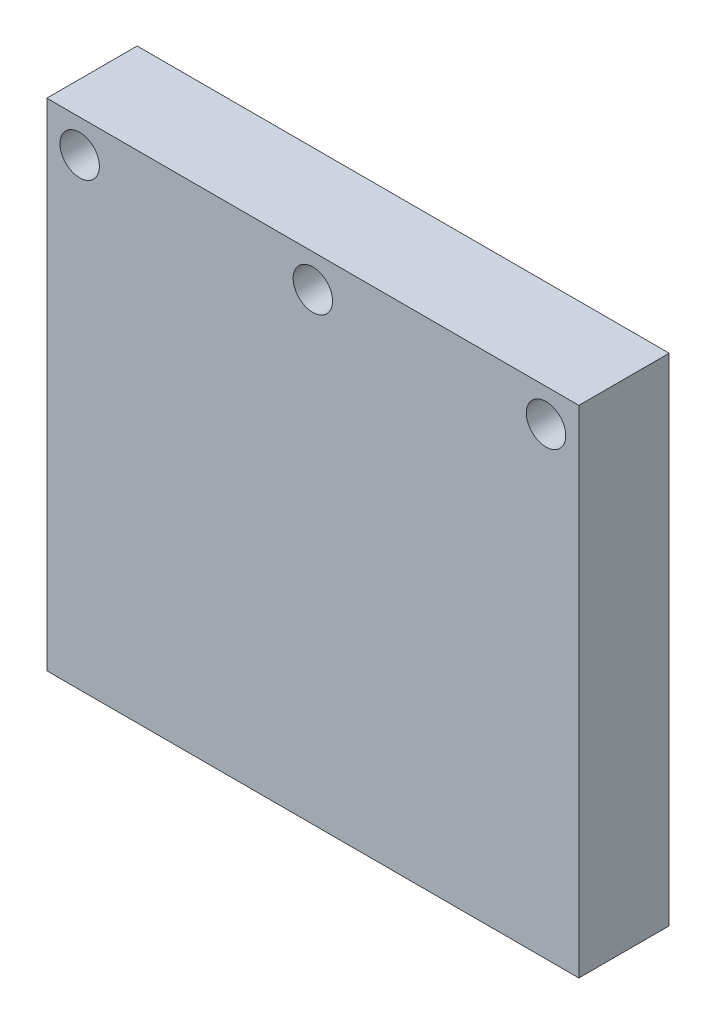
ISO-10303-21;
HEADER;
FILE_DESCRIPTION(('STEP AP214'),'2;1');
FILE_NAME('part.step','',(''),(''),'','','');
FILE_SCHEMA(('AUTOMOTIVE_DESIGN { 1 0 10303 214 1 1 1 1 }'));
ENDSEC;
DATA;
#1=APPLICATION_CONTEXT('core data for automotive mechanical design processes');
#2=APPLICATION_PROTOCOL_DEFINITION('international standard','automotive_design',2000,#1);
#3=PRODUCT_CONTEXT('',#1,'mechanical');
#4=PRODUCT('Part','Part','',(#3));
#5=PRODUCT_RELATED_PRODUCT_CATEGORY('part','',(#4));
#6=PRODUCT_DEFINITION_FORMATION('','',#4);
#7=PRODUCT_DEFINITION_CONTEXT('part definition',#1,'design');
#8=PRODUCT_DEFINITION('design','',#6,#7);
#9=PRODUCT_DEFINITION_SHAPE('','',#8);
#10=(LENGTH_UNIT() NAMED_UNIT(*) SI_UNIT(.MILLI.,.METRE.));
#11=(NAMED_UNIT(*) PLANE_ANGLE_UNIT() SI_UNIT($,.RADIAN.));
#12=(NAMED_UNIT(*) SI_UNIT($,.STERADIAN.) SOLID_ANGLE_UNIT());
#13=UNCERTAINTY_MEASURE_WITH_UNIT(LENGTH_MEASURE(1.E-05),#10,'distance_accuracy_value','');
#14=(GEOMETRIC_REPRESENTATION_CONTEXT(3) GLOBAL_UNCERTAINTY_ASSIGNED_CONTEXT((#13)) GLOBAL_UNIT_ASSIGNED_CONTEXT((#10,
#11,#12)) REPRESENTATION_CONTEXT('',''));
#15=CARTESIAN_POINT('',(0.,0.,0.));
#16=DIRECTION('',(0.,0.,1.));
#17=DIRECTION('',(1.,0.,0.));
#18=AXIS2_PLACEMENT_3D('',#15,#16,#17);
#19=CARTESIAN_POINT('',(8.10000000000002,7.55000000000003,2.75));
#20=DIRECTION('',(-1.,0.,0.));
#21=DIRECTION('',(0.,0.,1.));
#22=AXIS2_PLACEMENT_3D('',#19,#20,#21);
#23=PLANE('',#22);
#24=DIRECTION('',(0.,1.,0.));
#25=VECTOR('',#24,1.);
#26=CARTESIAN_POINT('',(8.10000000000002,7.55000000000003,0.));
#27=LINE('',#26,#25);
#28=CARTESIAN_POINT('',(8.10000000000002,-7.54999999999997,0.));
#29=VERTEX_POINT('',#28);
#30=CARTESIAN_POINT('',(8.10000000000002,7.55000000000003,0.));
#31=VERTEX_POINT('',#30);
#32=EDGE_CURVE('E109',#29,#31,#27,.T.);
#33=ORIENTED_EDGE('',*,*,#32,.T.);
#34=DIRECTION('',(0.,0.,-1.));
#35=VECTOR('',#34,1.);
#36=CARTESIAN_POINT('',(8.10000000000002,7.55000000000003,2.75));
#37=LINE('',#36,#35);
#38=CARTESIAN_POINT('',(8.10000000000002,7.55000000000003,2.75));
#39=VERTEX_POINT('',#38);
#40=EDGE_CURVE('E11',#39,#31,#37,.T.);
#41=ORIENTED_EDGE('',*,*,#40,.F.);
#42=DIRECTION('',(0.,1.,0.));
#43=VECTOR('',#42,1.);
#44=CARTESIAN_POINT('',(8.10000000000002,7.55000000000003,2.75));
#45=LINE('',#44,#43);
#46=CARTESIAN_POINT('',(8.10000000000002,-7.54999999999997,2.75));
#47=VERTEX_POINT('',#46);
#48=EDGE_CURVE('E92',#47,#39,#45,.T.);
#49=ORIENTED_EDGE('',*,*,#48,.F.);
#50=DIRECTION('',(0.,0.,-1.));
#51=VECTOR('',#50,1.);
#52=CARTESIAN_POINT('',(8.10000000000002,-7.54999999999997,2.75));
#53=LINE('',#52,#51);
#54=EDGE_CURVE('E105',#47,#29,#53,.T.);
#55=ORIENTED_EDGE('',*,*,#54,.T.);
#56=EDGE_LOOP('',(#33,#41,#49,#55));
#57=FACE_BOUND('',#56,.T.);
#58=ADVANCED_FACE('F39',(#57),#23,.F.);
#59=CARTESIAN_POINT('',(-8.09999999999997,7.55000000000003,2.75));
#60=DIRECTION('',(0.,-1.,0.));
#61=DIRECTION('',(0.,0.,-1.));
#62=AXIS2_PLACEMENT_3D('',#59,#60,#61);
#63=PLANE('',#62);
#64=DIRECTION('',(-1.,0.,0.));
#65=VECTOR('',#64,1.);
#66=CARTESIAN_POINT('',(-8.09999999999997,7.55000000000003,0.));
#67=LINE('',#66,#65);
#68=CARTESIAN_POINT('',(-8.09999999999997,7.55000000000003,0.));
#69=VERTEX_POINT('',#68);
#70=EDGE_CURVE('E97',#31,#69,#67,.T.);
#71=ORIENTED_EDGE('',*,*,#70,.T.);
#72=DIRECTION('',(0.,0.,-1.));
#73=VECTOR('',#72,1.);
#74=CARTESIAN_POINT('',(-8.09999999999997,7.55000000000003,2.75));
#75=LINE('',#74,#73);
#76=CARTESIAN_POINT('',(-8.09999999999997,7.55000000000003,2.75));
#77=VERTEX_POINT('',#76);
#78=EDGE_CURVE('E49',#77,#69,#75,.T.);
#79=ORIENTED_EDGE('',*,*,#78,.F.);
#80=DIRECTION('',(-1.,0.,0.));
#81=VECTOR('',#80,1.);
#82=CARTESIAN_POINT('',(-8.09999999999997,7.55000000000003,2.75));
#83=LINE('',#82,#81);
#84=EDGE_CURVE('E87',#39,#77,#83,.T.);
#85=ORIENTED_EDGE('',*,*,#84,.F.);
#86=ORIENTED_EDGE('',*,*,#40,.T.);
#87=EDGE_LOOP('',(#71,#79,#85,#86));
#88=FACE_BOUND('',#87,.T.);
#89=ADVANCED_FACE('F96',(#88),#63,.F.);
#90=CARTESIAN_POINT('',(-8.09999999999997,7.55000000000003,2.75));
#91=DIRECTION('',(1.,0.,0.));
#92=DIRECTION('',(0.,0.,-1.));
#93=AXIS2_PLACEMENT_3D('',#90,#91,#92);
#94=PLANE('',#93);
#95=DIRECTION('',(0.,-1.,0.));
#96=VECTOR('',#95,1.);
#97=CARTESIAN_POINT('',(-8.09999999999997,7.55000000000003,0.));
#98=LINE('',#97,#96);
#99=CARTESIAN_POINT('',(-8.09999999999997,-7.54999999999997,0.));
#100=VERTEX_POINT('',#99);
#101=EDGE_CURVE('E74',#69,#100,#98,.T.);
#102=ORIENTED_EDGE('',*,*,#101,.T.);
#103=DIRECTION('',(0.,0.,-1.));
#104=VECTOR('',#103,1.);
#105=CARTESIAN_POINT('',(-8.09999999999997,-7.54999999999997,2.75));
#106=LINE('',#105,#104);
#107=CARTESIAN_POINT('',(-8.09999999999997,-7.54999999999997,2.75));
#108=VERTEX_POINT('',#107);
#109=EDGE_CURVE('E99',#108,#100,#106,.T.);
#110=ORIENTED_EDGE('',*,*,#109,.F.);
#111=DIRECTION('',(0.,-1.,0.));
#112=VECTOR('',#111,1.);
#113=CARTESIAN_POINT('',(-8.09999999999997,7.55000000000003,2.75));
#114=LINE('',#113,#112);
#115=EDGE_CURVE('E90',#77,#108,#114,.T.);
#116=ORIENTED_EDGE('',*,*,#115,.F.);
#117=ORIENTED_EDGE('',*,*,#78,.T.);
#118=EDGE_LOOP('',(#102,#110,#116,#117));
#119=FACE_BOUND('',#118,.T.);
#120=ADVANCED_FACE('F101',(#119),#94,.F.);
#121=CARTESIAN_POINT('',(-8.09999999999997,-7.54999999999997,2.75));
#122=DIRECTION('',(0.,1.,0.));
#123=DIRECTION('',(0.,0.,1.));
#124=AXIS2_PLACEMENT_3D('',#121,#122,#123);
#125=PLANE('',#124);
#126=DIRECTION('',(1.,0.,0.));
#127=VECTOR('',#126,1.);
#128=CARTESIAN_POINT('',(-8.09999999999997,-7.54999999999997,0.));
#129=LINE('',#128,#127);
#130=EDGE_CURVE('E80',#100,#29,#129,.T.);
#131=ORIENTED_EDGE('',*,*,#130,.T.);
#132=ORIENTED_EDGE('',*,*,#54,.F.);
#133=DIRECTION('',(1.,0.,0.));
#134=VECTOR('',#133,1.);
#135=CARTESIAN_POINT('',(-8.09999999999997,-7.54999999999997,2.75));
#136=LINE('',#135,#134);
#137=EDGE_CURVE('E57',#108,#47,#136,.T.);
#138=ORIENTED_EDGE('',*,*,#137,.F.);
#139=ORIENTED_EDGE('',*,*,#109,.T.);
#140=EDGE_LOOP('',(#131,#132,#138,#139));
#141=FACE_BOUND('',#140,.T.);
#142=ADVANCED_FACE('F123',(#141),#125,.F.);
#143=CARTESIAN_POINT('',(0.,0.,2.75));
#144=DIRECTION('',(0.,0.,1.));
#145=DIRECTION('',(1.,0.,0.));
#146=AXIS2_PLACEMENT_3D('',#143,#144,#145);
#147=PLANE('',#146);
#148=CARTESIAN_POINT('',(0.,6.55000000000003,2.75));
#149=DIRECTION('',(0.,0.,1.));
#150=DIRECTION('',(1.,0.,0.));
#151=AXIS2_PLACEMENT_3D('',#148,#149,#150);
#152=CIRCLE('',#151,0.6);
#153=CARTESIAN_POINT('',(0.6,6.55000000000003,2.75));
#154=VERTEX_POINT('',#153);
#155=EDGE_CURVE('E145',#154,#154,#152,.T.);
#156=ORIENTED_EDGE('',*,*,#155,.F.);
#157=EDGE_LOOP('',(#156));
#158=FACE_BOUND('',#157,.T.);
#159=CARTESIAN_POINT('',(-7.10000000000002,6.55000000000003,2.75));
#160=DIRECTION('',(0.,0.,1.));
#161=DIRECTION('',(1.,0.,0.));
#162=AXIS2_PLACEMENT_3D('',#159,#160,#161);
#163=CIRCLE('',#162,0.599999999999999);
#164=CARTESIAN_POINT('',(-6.50000000000002,6.55000000000003,2.75));
#165=VERTEX_POINT('',#164);
#166=EDGE_CURVE('E137',#165,#165,#163,.T.);
#167=ORIENTED_EDGE('',*,*,#166,.F.);
#168=EDGE_LOOP('',(#167));
#169=FACE_BOUND('',#168,.T.);
#170=CARTESIAN_POINT('',(7.10000000000002,6.55000000000003,2.75));
#171=DIRECTION('',(0.,0.,1.));
#172=DIRECTION('',(1.,0.,0.));
#173=AXIS2_PLACEMENT_3D('',#170,#171,#172);
#174=CIRCLE('',#173,0.599999999999999);
#175=CARTESIAN_POINT('',(7.70000000000002,6.55000000000003,2.75));
#176=VERTEX_POINT('',#175);
#177=EDGE_CURVE('E133',#176,#176,#174,.T.);
#178=ORIENTED_EDGE('',*,*,#177,.F.);
#179=EDGE_LOOP('',(#178));
#180=FACE_BOUND('',#179,.T.);
#181=ORIENTED_EDGE('',*,*,#48,.T.);
#182=ORIENTED_EDGE('',*,*,#84,.T.);
#183=ORIENTED_EDGE('',*,*,#115,.T.);
#184=ORIENTED_EDGE('',*,*,#137,.T.);
#185=EDGE_LOOP('',(#181,#182,#183,#184));
#186=FACE_BOUND('',#185,.T.);
#187=ADVANCED_FACE('F88',(#158,#169,#180,#186),#147,.T.);
#188=CARTESIAN_POINT('',(0.,0.,0.));
#189=DIRECTION('',(0.,0.,1.));
#190=DIRECTION('',(1.,0.,0.));
#191=AXIS2_PLACEMENT_3D('',#188,#189,#190);
#192=PLANE('',#191);
#193=CARTESIAN_POINT('',(0.,6.55000000000003,0.));
#194=DIRECTION('',(0.,0.,1.));
#195=DIRECTION('',(1.,0.,0.));
#196=AXIS2_PLACEMENT_3D('',#193,#194,#195);
#197=CIRCLE('',#196,0.6);
#198=CARTESIAN_POINT('',(0.6,6.55000000000003,0.));
#199=VERTEX_POINT('',#198);
#200=EDGE_CURVE('E141',#199,#199,#197,.T.);
#201=ORIENTED_EDGE('',*,*,#200,.T.);
#202=EDGE_LOOP('',(#201));
#203=FACE_BOUND('',#202,.T.);
#204=CARTESIAN_POINT('',(-7.10000000000002,6.55000000000003,0.));
#205=DIRECTION('',(0.,0.,1.));
#206=DIRECTION('',(1.,0.,0.));
#207=AXIS2_PLACEMENT_3D('',#204,#205,#206);
#208=CIRCLE('',#207,0.599999999999999);
#209=CARTESIAN_POINT('',(-6.50000000000002,6.55000000000003,0.));
#210=VERTEX_POINT('',#209);
#211=EDGE_CURVE('E42',#210,#210,#208,.T.);
#212=ORIENTED_EDGE('',*,*,#211,.T.);
#213=EDGE_LOOP('',(#212));
#214=FACE_BOUND('',#213,.T.);
#215=CARTESIAN_POINT('',(7.10000000000002,6.55000000000003,0.));
#216=DIRECTION('',(0.,0.,1.));
#217=DIRECTION('',(1.,0.,0.));
#218=AXIS2_PLACEMENT_3D('',#215,#216,#217);
#219=CIRCLE('',#218,0.599999999999999);
#220=CARTESIAN_POINT('',(7.70000000000002,6.55000000000003,0.));
#221=VERTEX_POINT('',#220);
#222=EDGE_CURVE('E113',#221,#221,#219,.T.);
#223=ORIENTED_EDGE('',*,*,#222,.T.);
#224=EDGE_LOOP('',(#223));
#225=FACE_BOUND('',#224,.T.);
#226=ORIENTED_EDGE('',*,*,#32,.F.);
#227=ORIENTED_EDGE('',*,*,#130,.F.);
#228=ORIENTED_EDGE('',*,*,#101,.F.);
#229=ORIENTED_EDGE('',*,*,#70,.F.);
#230=EDGE_LOOP('',(#226,#227,#228,#229));
#231=FACE_BOUND('',#230,.T.);
#232=ADVANCED_FACE('F126',(#203,#214,#225,#231),#192,.F.);
#233=CARTESIAN_POINT('',(7.10000000000002,6.55000000000003,2.75));
#234=DIRECTION('',(0.,0.,1.));
#235=DIRECTION('',(1.,0.,0.));
#236=AXIS2_PLACEMENT_3D('',#233,#234,#235);
#237=CYLINDRICAL_SURFACE('',#236,0.599999999999999);
#238=ORIENTED_EDGE('',*,*,#177,.T.);
#239=EDGE_LOOP('',(#238));
#240=FACE_BOUND('',#239,.T.);
#241=ORIENTED_EDGE('',*,*,#222,.F.);
#242=EDGE_LOOP('',(#241));
#243=FACE_BOUND('',#242,.T.);
#244=ADVANCED_FACE('F159',(#240,#243),#237,.F.);
#245=CARTESIAN_POINT('',(-7.10000000000002,6.55000000000003,2.75));
#246=DIRECTION('',(0.,0.,1.));
#247=DIRECTION('',(1.,0.,0.));
#248=AXIS2_PLACEMENT_3D('',#245,#246,#247);
#249=CYLINDRICAL_SURFACE('',#248,0.599999999999999);
#250=ORIENTED_EDGE('',*,*,#166,.T.);
#251=EDGE_LOOP('',(#250));
#252=FACE_BOUND('',#251,.T.);
#253=ORIENTED_EDGE('',*,*,#211,.F.);
#254=EDGE_LOOP('',(#253));
#255=FACE_BOUND('',#254,.T.);
#256=ADVANCED_FACE('F162',(#252,#255),#249,.F.);
#257=CARTESIAN_POINT('',(0.,6.55000000000003,2.75));
#258=DIRECTION('',(0.,0.,1.));
#259=DIRECTION('',(1.,0.,0.));
#260=AXIS2_PLACEMENT_3D('',#257,#258,#259);
#261=CYLINDRICAL_SURFACE('',#260,0.6);
#262=ORIENTED_EDGE('',*,*,#200,.F.);
#263=EDGE_LOOP('',(#262));
#264=FACE_BOUND('',#263,.T.);
#265=ORIENTED_EDGE('',*,*,#155,.T.);
#266=EDGE_LOOP('',(#265));
#267=FACE_BOUND('',#266,.T.);
#268=ADVANCED_FACE('F150',(#264,#267),#261,.F.);
#269=CLOSED_SHELL('',(#58,#89,#120,#142,#187,#232,#244,#256,#268));
#270=MANIFOLD_SOLID_BREP('B2',#269);
#271=ADVANCED_BREP_SHAPE_REPRESENTATION('',(#18,#270),#14);
#272=SHAPE_DEFINITION_REPRESENTATION(#9,#271);
ENDSEC;
END-ISO-10303-21;
